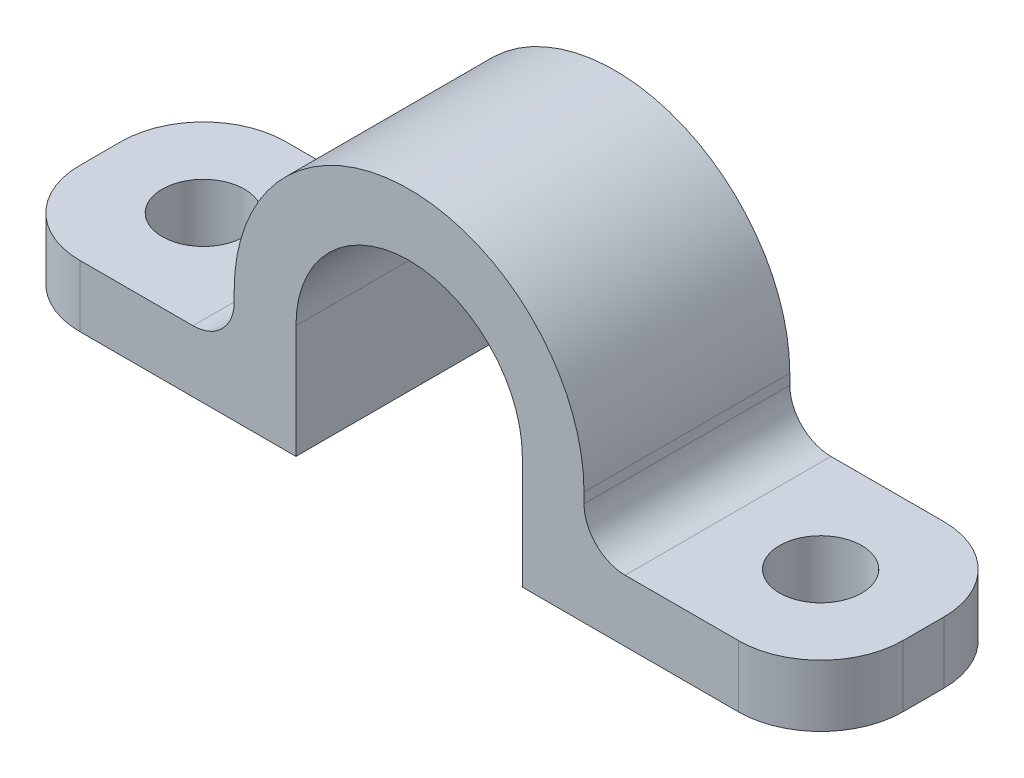
ISO-10303-21;
HEADER;
FILE_DESCRIPTION(('STEP AP214'),'2;1');
FILE_NAME('part.step','',(''),(''),'','','');
FILE_SCHEMA(('AUTOMOTIVE_DESIGN { 1 0 10303 214 1 1 1 1 }'));
ENDSEC;
DATA;
#1=APPLICATION_CONTEXT('core data for automotive mechanical design processes');
#2=APPLICATION_PROTOCOL_DEFINITION('international standard','automotive_design',2000,#1);
#3=PRODUCT_CONTEXT('',#1,'mechanical');
#4=PRODUCT('Part','Part','',(#3));
#5=PRODUCT_RELATED_PRODUCT_CATEGORY('part','',(#4));
#6=PRODUCT_DEFINITION_FORMATION('','',#4);
#7=PRODUCT_DEFINITION_CONTEXT('part definition',#1,'design');
#8=PRODUCT_DEFINITION('design','',#6,#7);
#9=PRODUCT_DEFINITION_SHAPE('','',#8);
#10=(LENGTH_UNIT() NAMED_UNIT(*) SI_UNIT(.MILLI.,.METRE.));
#11=(NAMED_UNIT(*) PLANE_ANGLE_UNIT() SI_UNIT($,.RADIAN.));
#12=(NAMED_UNIT(*) SI_UNIT($,.STERADIAN.) SOLID_ANGLE_UNIT());
#13=UNCERTAINTY_MEASURE_WITH_UNIT(LENGTH_MEASURE(1.E-05),#10,'distance_accuracy_value','');
#14=(GEOMETRIC_REPRESENTATION_CONTEXT(3) GLOBAL_UNCERTAINTY_ASSIGNED_CONTEXT((#13)) GLOBAL_UNIT_ASSIGNED_CONTEXT((#10,
#11,#12)) REPRESENTATION_CONTEXT('',''));
#15=CARTESIAN_POINT('',(0.,0.,0.));
#16=DIRECTION('',(0.,0.,1.));
#17=DIRECTION('',(1.,0.,0.));
#18=AXIS2_PLACEMENT_3D('',#15,#16,#17);
#19=CARTESIAN_POINT('',(0.,-2.5,5.));
#20=DIRECTION('',(0.,1.,0.));
#21=DIRECTION('',(0.,0.,1.));
#22=AXIS2_PLACEMENT_3D('',#19,#20,#21);
#23=PLANE('',#22);
#24=CARTESIAN_POINT('',(15.,-2.5,0.));
#25=DIRECTION('',(0.,1.,0.));
#26=DIRECTION('',(1.,0.,0.));
#27=AXIS2_PLACEMENT_3D('',#24,#25,#26);
#28=CIRCLE('',#27,2.);
#29=CARTESIAN_POINT('',(17.,-2.5,0.));
#30=VERTEX_POINT('',#29);
#31=EDGE_CURVE('E606',#30,#30,#28,.T.);
#32=ORIENTED_EDGE('',*,*,#31,.F.);
#33=EDGE_LOOP('',(#32));
#34=FACE_BOUND('',#33,.T.);
#35=DIRECTION('',(1.,0.,0.));
#36=VECTOR('',#35,1.);
#37=CARTESIAN_POINT('',(0.,-2.5,-5.));
#38=LINE('',#37,#36);
#39=CARTESIAN_POINT('',(10.5,-2.5,-5.));
#40=VERTEX_POINT('',#39);
#41=CARTESIAN_POINT('',(16.,-2.5,-5.));
#42=VERTEX_POINT('',#41);
#43=EDGE_CURVE('E210',#40,#42,#38,.T.);
#44=ORIENTED_EDGE('',*,*,#43,.F.);
#45=DIRECTION('',(0.,0.,-1.));
#46=VECTOR('',#45,1.);
#47=CARTESIAN_POINT('',(10.5,-2.5,5.));
#48=LINE('',#47,#46);
#49=CARTESIAN_POINT('',(10.5,-2.5,5.));
#50=VERTEX_POINT('',#49);
#51=EDGE_CURVE('E293',#40,#50,#48,.F.);
#52=ORIENTED_EDGE('',*,*,#51,.T.);
#53=DIRECTION('',(1.,0.,0.));
#54=VECTOR('',#53,1.);
#55=CARTESIAN_POINT('',(0.,-2.5,5.));
#56=LINE('',#55,#54);
#57=CARTESIAN_POINT('',(16.,-2.5,5.));
#58=VERTEX_POINT('',#57);
#59=EDGE_CURVE('E187',#50,#58,#56,.T.);
#60=ORIENTED_EDGE('',*,*,#59,.T.);
#61=CARTESIAN_POINT('',(16.,-2.5,1.));
#62=DIRECTION('',(0.,1.,0.));
#63=DIRECTION('',(0.,0.,1.));
#64=AXIS2_PLACEMENT_3D('',#61,#62,#63);
#65=CIRCLE('',#64,4.);
#66=CARTESIAN_POINT('',(20.,-2.5,1.));
#67=VERTEX_POINT('',#66);
#68=EDGE_CURVE('E267',#58,#67,#65,.T.);
#69=ORIENTED_EDGE('',*,*,#68,.T.);
#70=DIRECTION('',(0.,0.,-1.));
#71=VECTOR('',#70,1.);
#72=CARTESIAN_POINT('',(20.,-2.5,5.));
#73=LINE('',#72,#71);
#74=CARTESIAN_POINT('',(20.,-2.5,-1.));
#75=VERTEX_POINT('',#74);
#76=EDGE_CURVE('E209',#67,#75,#73,.T.);
#77=ORIENTED_EDGE('',*,*,#76,.T.);
#78=CARTESIAN_POINT('',(16.,-2.5,-1.));
#79=DIRECTION('',(0.,1.,0.));
#80=DIRECTION('',(0.,0.,1.));
#81=AXIS2_PLACEMENT_3D('',#78,#79,#80);
#82=CIRCLE('',#81,4.);
#83=EDGE_CURVE('E269',#75,#42,#82,.T.);
#84=ORIENTED_EDGE('',*,*,#83,.T.);
#85=EDGE_LOOP('',(#44,#52,#60,#69,#77,#84));
#86=FACE_BOUND('',#85,.T.);
#87=ADVANCED_FACE('F36',(#34,#86),#23,.T.);
#88=CARTESIAN_POINT('',(8.5,0.,5.));
#89=DIRECTION('',(1.,0.,0.));
#90=DIRECTION('',(0.,0.,-1.));
#91=AXIS2_PLACEMENT_3D('',#88,#89,#90);
#92=PLANE('',#91);
#93=DIRECTION('',(0.,-1.,0.));
#94=VECTOR('',#93,1.);
#95=CARTESIAN_POINT('',(8.5,0.,5.));
#96=LINE('',#95,#94);
#97=CARTESIAN_POINT('',(8.5,0.,5.));
#98=VERTEX_POINT('',#97);
#99=CARTESIAN_POINT('',(8.5,-0.5,5.));
#100=VERTEX_POINT('',#99);
#101=EDGE_CURVE('E166',#98,#100,#96,.T.);
#102=ORIENTED_EDGE('',*,*,#101,.T.);
#103=DIRECTION('',(0.,0.,-1.));
#104=VECTOR('',#103,1.);
#105=CARTESIAN_POINT('',(8.5,-0.5,-5.));
#106=LINE('',#105,#104);
#107=CARTESIAN_POINT('',(8.5,-0.5,-5.));
#108=VERTEX_POINT('',#107);
#109=EDGE_CURVE('E291',#100,#108,#106,.T.);
#110=ORIENTED_EDGE('',*,*,#109,.T.);
#111=DIRECTION('',(0.,-1.,0.));
#112=VECTOR('',#111,1.);
#113=CARTESIAN_POINT('',(8.5,0.,-5.));
#114=LINE('',#113,#112);
#115=CARTESIAN_POINT('',(8.5,0.,-5.));
#116=VERTEX_POINT('',#115);
#117=EDGE_CURVE('E169',#116,#108,#114,.T.);
#118=ORIENTED_EDGE('',*,*,#117,.F.);
#119=DIRECTION('',(0.,0.,-1.));
#120=VECTOR('',#119,1.);
#121=CARTESIAN_POINT('',(8.5,0.,5.));
#122=LINE('',#121,#120);
#123=EDGE_CURVE('E161',#98,#116,#122,.T.);
#124=ORIENTED_EDGE('',*,*,#123,.F.);
#125=EDGE_LOOP('',(#102,#110,#118,#124));
#126=FACE_BOUND('',#125,.T.);
#127=ADVANCED_FACE('F163',(#126),#92,.T.);
#128=CARTESIAN_POINT('',(0.,0.,5.));
#129=DIRECTION('',(0.,0.,-1.));
#130=DIRECTION('',(-1.,0.,0.));
#131=AXIS2_PLACEMENT_3D('',#128,#129,#130);
#132=CYLINDRICAL_SURFACE('',#131,8.5);
#133=CARTESIAN_POINT('',(0.,0.,-5.));
#134=DIRECTION('',(0.,0.,1.));
#135=DIRECTION('',(1.,0.,0.));
#136=AXIS2_PLACEMENT_3D('',#133,#134,#135);
#137=CIRCLE('',#136,8.5);
#138=CARTESIAN_POINT('',(-8.5,0.,-5.));
#139=VERTEX_POINT('',#138);
#140=EDGE_CURVE('E214',#116,#139,#137,.T.);
#141=ORIENTED_EDGE('',*,*,#140,.T.);
#142=DIRECTION('',(0.,0.,-1.));
#143=VECTOR('',#142,1.);
#144=CARTESIAN_POINT('',(-8.5,0.,5.));
#145=LINE('',#144,#143);
#146=CARTESIAN_POINT('',(-8.5,0.,5.));
#147=VERTEX_POINT('',#146);
#148=EDGE_CURVE('E173',#147,#139,#145,.T.);
#149=ORIENTED_EDGE('',*,*,#148,.F.);
#150=CARTESIAN_POINT('',(0.,0.,5.));
#151=DIRECTION('',(0.,0.,1.));
#152=DIRECTION('',(1.,0.,0.));
#153=AXIS2_PLACEMENT_3D('',#150,#151,#152);
#154=CIRCLE('',#153,8.5);
#155=EDGE_CURVE('E176',#98,#147,#154,.T.);
#156=ORIENTED_EDGE('',*,*,#155,.F.);
#157=ORIENTED_EDGE('',*,*,#123,.T.);
#158=EDGE_LOOP('',(#141,#149,#156,#157));
#159=FACE_BOUND('',#158,.T.);
#160=ADVANCED_FACE('F177',(#159),#132,.T.);
#161=CARTESIAN_POINT('',(-8.5,0.,5.));
#162=DIRECTION('',(1.,0.,0.));
#163=DIRECTION('',(0.,0.,-1.));
#164=AXIS2_PLACEMENT_3D('',#161,#162,#163);
#165=PLANE('',#164);
#166=DIRECTION('',(0.,-1.,0.));
#167=VECTOR('',#166,1.);
#168=CARTESIAN_POINT('',(-8.5,0.,-5.));
#169=LINE('',#168,#167);
#170=CARTESIAN_POINT('',(-8.5,-0.5,-5.));
#171=VERTEX_POINT('',#170);
#172=EDGE_CURVE('E216',#139,#171,#169,.T.);
#173=ORIENTED_EDGE('',*,*,#172,.T.);
#174=DIRECTION('',(0.,0.,-1.));
#175=VECTOR('',#174,1.);
#176=CARTESIAN_POINT('',(-8.5,-0.5,5.));
#177=LINE('',#176,#175);
#178=CARTESIAN_POINT('',(-8.5,-0.5,5.));
#179=VERTEX_POINT('',#178);
#180=EDGE_CURVE('E51',#171,#179,#177,.F.);
#181=ORIENTED_EDGE('',*,*,#180,.T.);
#182=DIRECTION('',(0.,-1.,0.));
#183=VECTOR('',#182,1.);
#184=CARTESIAN_POINT('',(-8.5,0.,5.));
#185=LINE('',#184,#183);
#186=EDGE_CURVE('E180',#147,#179,#185,.T.);
#187=ORIENTED_EDGE('',*,*,#186,.F.);
#188=ORIENTED_EDGE('',*,*,#148,.T.);
#189=EDGE_LOOP('',(#173,#181,#187,#188));
#190=FACE_BOUND('',#189,.T.);
#191=ADVANCED_FACE('F411',(#190),#165,.F.);
#192=CARTESIAN_POINT('',(0.,-2.5,5.));
#193=DIRECTION('',(0.,1.,0.));
#194=DIRECTION('',(0.,0.,1.));
#195=AXIS2_PLACEMENT_3D('',#192,#193,#194);
#196=PLANE('',#195);
#197=CARTESIAN_POINT('',(-15.,-2.5,0.));
#198=DIRECTION('',(0.,1.,0.));
#199=DIRECTION('',(-1.,0.,0.));
#200=AXIS2_PLACEMENT_3D('',#197,#198,#199);
#201=CIRCLE('',#200,2.);
#202=CARTESIAN_POINT('',(-17.,-2.5,0.));
#203=VERTEX_POINT('',#202);
#204=EDGE_CURVE('E602',#203,#203,#201,.T.);
#205=ORIENTED_EDGE('',*,*,#204,.F.);
#206=EDGE_LOOP('',(#205));
#207=FACE_BOUND('',#206,.T.);
#208=DIRECTION('',(1.,0.,0.));
#209=VECTOR('',#208,1.);
#210=CARTESIAN_POINT('',(0.,-2.5,5.));
#211=LINE('',#210,#209);
#212=CARTESIAN_POINT('',(-16.,-2.5,5.));
#213=VERTEX_POINT('',#212);
#214=CARTESIAN_POINT('',(-10.5,-2.5,5.));
#215=VERTEX_POINT('',#214);
#216=EDGE_CURVE('E194',#213,#215,#211,.T.);
#217=ORIENTED_EDGE('',*,*,#216,.T.);
#218=DIRECTION('',(0.,0.,-1.));
#219=VECTOR('',#218,1.);
#220=CARTESIAN_POINT('',(-10.5,-2.5,5.));
#221=LINE('',#220,#219);
#222=CARTESIAN_POINT('',(-10.5,-2.5,-5.));
#223=VERTEX_POINT('',#222);
#224=EDGE_CURVE('E295',#215,#223,#221,.T.);
#225=ORIENTED_EDGE('',*,*,#224,.T.);
#226=DIRECTION('',(1.,0.,0.));
#227=VECTOR('',#226,1.);
#228=CARTESIAN_POINT('',(0.,-2.5,-5.));
#229=LINE('',#228,#227);
#230=CARTESIAN_POINT('',(-16.,-2.5,-5.));
#231=VERTEX_POINT('',#230);
#232=EDGE_CURVE('E218',#231,#223,#229,.T.);
#233=ORIENTED_EDGE('',*,*,#232,.F.);
#234=CARTESIAN_POINT('',(-16.,-2.5,-1.));
#235=DIRECTION('',(0.,1.,0.));
#236=DIRECTION('',(0.,0.,1.));
#237=AXIS2_PLACEMENT_3D('',#234,#235,#236);
#238=CIRCLE('',#237,4.);
#239=CARTESIAN_POINT('',(-20.,-2.5,-1.));
#240=VERTEX_POINT('',#239);
#241=EDGE_CURVE('E289',#231,#240,#238,.T.);
#242=ORIENTED_EDGE('',*,*,#241,.T.);
#243=DIRECTION('',(0.,0.,-1.));
#244=VECTOR('',#243,1.);
#245=CARTESIAN_POINT('',(-20.,-2.5,5.));
#246=LINE('',#245,#244);
#247=CARTESIAN_POINT('',(-20.,-2.5,1.));
#248=VERTEX_POINT('',#247);
#249=EDGE_CURVE('E250',#248,#240,#246,.T.);
#250=ORIENTED_EDGE('',*,*,#249,.F.);
#251=CARTESIAN_POINT('',(-16.,-2.5,1.));
#252=DIRECTION('',(0.,1.,0.));
#253=DIRECTION('',(0.,0.,1.));
#254=AXIS2_PLACEMENT_3D('',#251,#252,#253);
#255=CIRCLE('',#254,4.);
#256=EDGE_CURVE('E287',#248,#213,#255,.T.);
#257=ORIENTED_EDGE('',*,*,#256,.T.);
#258=EDGE_LOOP('',(#217,#225,#233,#242,#250,#257));
#259=FACE_BOUND('',#258,.T.);
#260=ADVANCED_FACE('F348',(#207,#259),#196,.T.);
#261=CARTESIAN_POINT('',(-20.,0.,5.));
#262=DIRECTION('',(1.,0.,0.));
#263=DIRECTION('',(0.,0.,-1.));
#264=AXIS2_PLACEMENT_3D('',#261,#262,#263);
#265=PLANE('',#264);
#266=ORIENTED_EDGE('',*,*,#249,.T.);
#267=DIRECTION('',(0.,-1.,0.));
#268=VECTOR('',#267,1.);
#269=CARTESIAN_POINT('',(-20.,0.,-1.));
#270=LINE('',#269,#268);
#271=CARTESIAN_POINT('',(-20.,-5.5,-1.));
#272=VERTEX_POINT('',#271);
#273=EDGE_CURVE('E280',#240,#272,#270,.T.);
#274=ORIENTED_EDGE('',*,*,#273,.T.);
#275=DIRECTION('',(0.,0.,-1.));
#276=VECTOR('',#275,1.);
#277=CARTESIAN_POINT('',(-20.,-5.5,5.));
#278=LINE('',#277,#276);
#279=CARTESIAN_POINT('',(-20.,-5.5,1.));
#280=VERTEX_POINT('',#279);
#281=EDGE_CURVE('E247',#280,#272,#278,.T.);
#282=ORIENTED_EDGE('',*,*,#281,.F.);
#283=DIRECTION('',(0.,-1.,0.));
#284=VECTOR('',#283,1.);
#285=CARTESIAN_POINT('',(-20.,-2.5,1.));
#286=LINE('',#285,#284);
#287=EDGE_CURVE('E278',#280,#248,#286,.F.);
#288=ORIENTED_EDGE('',*,*,#287,.T.);
#289=EDGE_LOOP('',(#266,#274,#282,#288));
#290=FACE_BOUND('',#289,.T.);
#291=ADVANCED_FACE('F351',(#290),#265,.F.);
#292=CARTESIAN_POINT('',(0.,-5.5,5.));
#293=DIRECTION('',(0.,1.,0.));
#294=DIRECTION('',(0.,0.,1.));
#295=AXIS2_PLACEMENT_3D('',#292,#293,#294);
#296=PLANE('',#295);
#297=CARTESIAN_POINT('',(-15.,-5.50000000000001,0.));
#298=DIRECTION('',(0.,1.,0.));
#299=DIRECTION('',(-1.,0.,0.));
#300=AXIS2_PLACEMENT_3D('',#297,#298,#299);
#301=CIRCLE('',#300,2.);
#302=CARTESIAN_POINT('',(-17.,-5.50000000000001,0.));
#303=VERTEX_POINT('',#302);
#304=EDGE_CURVE('E212',#303,#303,#301,.T.);
#305=ORIENTED_EDGE('',*,*,#304,.T.);
#306=EDGE_LOOP('',(#305));
#307=FACE_BOUND('',#306,.T.);
#308=ORIENTED_EDGE('',*,*,#281,.T.);
#309=CARTESIAN_POINT('',(-16.,-5.5,-1.));
#310=DIRECTION('',(0.,1.,0.));
#311=DIRECTION('',(0.,0.,1.));
#312=AXIS2_PLACEMENT_3D('',#309,#310,#311);
#313=CIRCLE('',#312,4.);
#314=CARTESIAN_POINT('',(-16.,-5.5,-5.));
#315=VERTEX_POINT('',#314);
#316=EDGE_CURVE('E285',#272,#315,#313,.F.);
#317=ORIENTED_EDGE('',*,*,#316,.T.);
#318=DIRECTION('',(1.,0.,0.));
#319=VECTOR('',#318,1.);
#320=CARTESIAN_POINT('',(0.,-5.5,-5.));
#321=LINE('',#320,#319);
#322=CARTESIAN_POINT('',(-5.5,-5.5,-5.));
#323=VERTEX_POINT('',#322);
#324=EDGE_CURVE('E220',#315,#323,#321,.T.);
#325=ORIENTED_EDGE('',*,*,#324,.T.);
#326=DIRECTION('',(0.,0.,-1.));
#327=VECTOR('',#326,1.);
#328=CARTESIAN_POINT('',(-5.5,-5.5,5.));
#329=LINE('',#328,#327);
#330=CARTESIAN_POINT('',(-5.5,-5.5,5.));
#331=VERTEX_POINT('',#330);
#332=EDGE_CURVE('E244',#331,#323,#329,.T.);
#333=ORIENTED_EDGE('',*,*,#332,.F.);
#334=DIRECTION('',(1.,0.,0.));
#335=VECTOR('',#334,1.);
#336=CARTESIAN_POINT('',(0.,-5.5,5.));
#337=LINE('',#336,#335);
#338=CARTESIAN_POINT('',(-16.,-5.5,5.));
#339=VERTEX_POINT('',#338);
#340=EDGE_CURVE('E197',#339,#331,#337,.T.);
#341=ORIENTED_EDGE('',*,*,#340,.F.);
#342=CARTESIAN_POINT('',(-16.,-5.5,1.));
#343=DIRECTION('',(0.,1.,0.));
#344=DIRECTION('',(0.,0.,1.));
#345=AXIS2_PLACEMENT_3D('',#342,#343,#344);
#346=CIRCLE('',#345,4.);
#347=EDGE_CURVE('E283',#339,#280,#346,.F.);
#348=ORIENTED_EDGE('',*,*,#347,.T.);
#349=EDGE_LOOP('',(#308,#317,#325,#333,#341,#348));
#350=FACE_BOUND('',#349,.T.);
#351=ADVANCED_FACE('F363',(#307,#350),#296,.F.);
#352=CARTESIAN_POINT('',(-5.5,0.,5.));
#353=DIRECTION('',(1.,0.,0.));
#354=DIRECTION('',(0.,1.,0.));
#355=AXIS2_PLACEMENT_3D('',#352,#353,#354);
#356=PLANE('',#355);
#357=DIRECTION('',(0.,-1.,0.));
#358=VECTOR('',#357,1.);
#359=CARTESIAN_POINT('',(-5.5,0.,-5.));
#360=LINE('',#359,#358);
#361=CARTESIAN_POINT('',(-5.5,0.,-5.));
#362=VERTEX_POINT('',#361);
#363=EDGE_CURVE('E222',#362,#323,#360,.T.);
#364=ORIENTED_EDGE('',*,*,#363,.F.);
#365=DIRECTION('',(0.,0.,-1.));
#366=VECTOR('',#365,1.);
#367=CARTESIAN_POINT('',(-5.5,0.,5.));
#368=LINE('',#367,#366);
#369=CARTESIAN_POINT('',(-5.5,0.,5.));
#370=VERTEX_POINT('',#369);
#371=EDGE_CURVE('E242',#370,#362,#368,.T.);
#372=ORIENTED_EDGE('',*,*,#371,.F.);
#373=DIRECTION('',(0.,-1.,0.));
#374=VECTOR('',#373,1.);
#375=CARTESIAN_POINT('',(-5.5,0.,5.));
#376=LINE('',#375,#374);
#377=EDGE_CURVE('E199',#370,#331,#376,.T.);
#378=ORIENTED_EDGE('',*,*,#377,.T.);
#379=ORIENTED_EDGE('',*,*,#332,.T.);
#380=EDGE_LOOP('',(#364,#372,#378,#379));
#381=FACE_BOUND('',#380,.T.);
#382=ADVANCED_FACE('F365',(#381),#356,.T.);
#383=CARTESIAN_POINT('',(0.,0.,5.));
#384=DIRECTION('',(0.,0.,-1.));
#385=DIRECTION('',(-1.,0.,0.));
#386=AXIS2_PLACEMENT_3D('',#383,#384,#385);
#387=CYLINDRICAL_SURFACE('',#386,5.5);
#388=CARTESIAN_POINT('',(0.,0.,-5.));
#389=DIRECTION('',(0.,0.,1.));
#390=DIRECTION('',(1.,0.,0.));
#391=AXIS2_PLACEMENT_3D('',#388,#389,#390);
#392=CIRCLE('',#391,5.5);
#393=CARTESIAN_POINT('',(5.5,0.,-5.));
#394=VERTEX_POINT('',#393);
#395=EDGE_CURVE('E225',#394,#362,#392,.T.);
#396=ORIENTED_EDGE('',*,*,#395,.F.);
#397=DIRECTION('',(0.,0.,-1.));
#398=VECTOR('',#397,1.);
#399=CARTESIAN_POINT('',(5.5,0.,5.));
#400=LINE('',#399,#398);
#401=CARTESIAN_POINT('',(5.5,0.,5.));
#402=VERTEX_POINT('',#401);
#403=EDGE_CURVE('E240',#402,#394,#400,.T.);
#404=ORIENTED_EDGE('',*,*,#403,.F.);
#405=CARTESIAN_POINT('',(0.,0.,5.));
#406=DIRECTION('',(0.,0.,1.));
#407=DIRECTION('',(1.,0.,0.));
#408=AXIS2_PLACEMENT_3D('',#405,#406,#407);
#409=CIRCLE('',#408,5.5);
#410=EDGE_CURVE('E202',#402,#370,#409,.T.);
#411=ORIENTED_EDGE('',*,*,#410,.T.);
#412=ORIENTED_EDGE('',*,*,#371,.T.);
#413=EDGE_LOOP('',(#396,#404,#411,#412));
#414=FACE_BOUND('',#413,.T.);
#415=ADVANCED_FACE('F370',(#414),#387,.F.);
#416=CARTESIAN_POINT('',(5.5,0.,5.));
#417=DIRECTION('',(1.,0.,0.));
#418=DIRECTION('',(0.,1.,0.));
#419=AXIS2_PLACEMENT_3D('',#416,#417,#418);
#420=PLANE('',#419);
#421=DIRECTION('',(0.,-1.,0.));
#422=VECTOR('',#421,1.);
#423=CARTESIAN_POINT('',(5.5,0.,-5.));
#424=LINE('',#423,#422);
#425=CARTESIAN_POINT('',(5.5,-5.5,-5.));
#426=VERTEX_POINT('',#425);
#427=EDGE_CURVE('E228',#394,#426,#424,.T.);
#428=ORIENTED_EDGE('',*,*,#427,.T.);
#429=DIRECTION('',(0.,0.,-1.));
#430=VECTOR('',#429,1.);
#431=CARTESIAN_POINT('',(5.5,-5.5,5.));
#432=LINE('',#431,#430);
#433=CARTESIAN_POINT('',(5.5,-5.5,5.));
#434=VERTEX_POINT('',#433);
#435=EDGE_CURVE('E237',#434,#426,#432,.T.);
#436=ORIENTED_EDGE('',*,*,#435,.F.);
#437=DIRECTION('',(0.,-1.,0.));
#438=VECTOR('',#437,1.);
#439=CARTESIAN_POINT('',(5.5,0.,5.));
#440=LINE('',#439,#438);
#441=EDGE_CURVE('E205',#402,#434,#440,.T.);
#442=ORIENTED_EDGE('',*,*,#441,.F.);
#443=ORIENTED_EDGE('',*,*,#403,.T.);
#444=EDGE_LOOP('',(#428,#436,#442,#443));
#445=FACE_BOUND('',#444,.T.);
#446=ADVANCED_FACE('F375',(#445),#420,.F.);
#447=CARTESIAN_POINT('',(0.,-5.5,5.));
#448=DIRECTION('',(0.,1.,0.));
#449=DIRECTION('',(0.,0.,1.));
#450=AXIS2_PLACEMENT_3D('',#447,#448,#449);
#451=PLANE('',#450);
#452=CARTESIAN_POINT('',(15.,-5.5,0.));
#453=DIRECTION('',(0.,1.,0.));
#454=DIRECTION('',(1.,0.,0.));
#455=AXIS2_PLACEMENT_3D('',#452,#453,#454);
#456=CIRCLE('',#455,2.);
#457=CARTESIAN_POINT('',(17.,-5.5,0.));
#458=VERTEX_POINT('',#457);
#459=EDGE_CURVE('E603',#458,#458,#456,.T.);
#460=ORIENTED_EDGE('',*,*,#459,.T.);
#461=EDGE_LOOP('',(#460));
#462=FACE_BOUND('',#461,.T.);
#463=DIRECTION('',(1.,0.,0.));
#464=VECTOR('',#463,1.);
#465=CARTESIAN_POINT('',(0.,-5.5,-5.));
#466=LINE('',#465,#464);
#467=CARTESIAN_POINT('',(16.,-5.5,-5.));
#468=VERTEX_POINT('',#467);
#469=EDGE_CURVE('E189',#426,#468,#466,.T.);
#470=ORIENTED_EDGE('',*,*,#469,.T.);
#471=CARTESIAN_POINT('',(16.,-5.5,-1.));
#472=DIRECTION('',(0.,1.,0.));
#473=DIRECTION('',(0.,0.,1.));
#474=AXIS2_PLACEMENT_3D('',#471,#472,#473);
#475=CIRCLE('',#474,4.);
#476=CARTESIAN_POINT('',(20.,-5.5,-1.));
#477=VERTEX_POINT('',#476);
#478=EDGE_CURVE('E260',#468,#477,#475,.F.);
#479=ORIENTED_EDGE('',*,*,#478,.T.);
#480=DIRECTION('',(0.,0.,-1.));
#481=VECTOR('',#480,1.);
#482=CARTESIAN_POINT('',(20.,-5.5,5.));
#483=LINE('',#482,#481);
#484=CARTESIAN_POINT('',(20.,-5.5,1.));
#485=VERTEX_POINT('',#484);
#486=EDGE_CURVE('E234',#485,#477,#483,.T.);
#487=ORIENTED_EDGE('',*,*,#486,.F.);
#488=CARTESIAN_POINT('',(16.,-5.5,1.));
#489=DIRECTION('',(0.,1.,0.));
#490=DIRECTION('',(0.,0.,1.));
#491=AXIS2_PLACEMENT_3D('',#488,#489,#490);
#492=CIRCLE('',#491,4.);
#493=CARTESIAN_POINT('',(16.,-5.5,5.));
#494=VERTEX_POINT('',#493);
#495=EDGE_CURVE('E258',#485,#494,#492,.F.);
#496=ORIENTED_EDGE('',*,*,#495,.T.);
#497=DIRECTION('',(1.,0.,0.));
#498=VECTOR('',#497,1.);
#499=CARTESIAN_POINT('',(0.,-5.5,5.));
#500=LINE('',#499,#498);
#501=EDGE_CURVE('E207',#434,#494,#500,.T.);
#502=ORIENTED_EDGE('',*,*,#501,.F.);
#503=ORIENTED_EDGE('',*,*,#435,.T.);
#504=EDGE_LOOP('',(#470,#479,#487,#496,#502,#503));
#505=FACE_BOUND('',#504,.T.);
#506=ADVANCED_FACE('F387',(#462,#505),#451,.F.);
#507=CARTESIAN_POINT('',(20.,0.,5.));
#508=DIRECTION('',(1.,0.,0.));
#509=DIRECTION('',(0.,0.,-1.));
#510=AXIS2_PLACEMENT_3D('',#507,#508,#509);
#511=PLANE('',#510);
#512=ORIENTED_EDGE('',*,*,#486,.T.);
#513=DIRECTION('',(0.,-1.,0.));
#514=VECTOR('',#513,1.);
#515=CARTESIAN_POINT('',(20.,-2.5,-1.));
#516=LINE('',#515,#514);
#517=EDGE_CURVE('E265',#477,#75,#516,.F.);
#518=ORIENTED_EDGE('',*,*,#517,.T.);
#519=ORIENTED_EDGE('',*,*,#76,.F.);
#520=DIRECTION('',(0.,-1.,0.));
#521=VECTOR('',#520,1.);
#522=CARTESIAN_POINT('',(20.,0.,1.));
#523=LINE('',#522,#521);
#524=EDGE_CURVE('E262',#67,#485,#523,.T.);
#525=ORIENTED_EDGE('',*,*,#524,.T.);
#526=EDGE_LOOP('',(#512,#518,#519,#525));
#527=FACE_BOUND('',#526,.T.);
#528=ADVANCED_FACE('F383',(#527),#511,.T.);
#529=CARTESIAN_POINT('',(0.,0.,5.));
#530=DIRECTION('',(0.,0.,1.));
#531=DIRECTION('',(1.,0.,0.));
#532=AXIS2_PLACEMENT_3D('',#529,#530,#531);
#533=PLANE('',#532);
#534=ORIENTED_EDGE('',*,*,#501,.T.);
#535=DIRECTION('',(0.,-1.,0.));
#536=VECTOR('',#535,1.);
#537=CARTESIAN_POINT('',(16.,0.,5.));
#538=LINE('',#537,#536);
#539=EDGE_CURVE('E275',#494,#58,#538,.F.);
#540=ORIENTED_EDGE('',*,*,#539,.T.);
#541=ORIENTED_EDGE('',*,*,#59,.F.);
#542=CARTESIAN_POINT('',(10.5,-0.5,5.));
#543=DIRECTION('',(0.,0.,1.));
#544=DIRECTION('',(1.,0.,0.));
#545=AXIS2_PLACEMENT_3D('',#542,#543,#544);
#546=CIRCLE('',#545,2.);
#547=EDGE_CURVE('E186',#50,#100,#546,.F.);
#548=ORIENTED_EDGE('',*,*,#547,.T.);
#549=ORIENTED_EDGE('',*,*,#101,.F.);
#550=ORIENTED_EDGE('',*,*,#155,.T.);
#551=ORIENTED_EDGE('',*,*,#186,.T.);
#552=CARTESIAN_POINT('',(-10.5,-0.5,5.));
#553=DIRECTION('',(0.,0.,1.));
#554=DIRECTION('',(1.,0.,0.));
#555=AXIS2_PLACEMENT_3D('',#552,#553,#554);
#556=CIRCLE('',#555,2.);
#557=EDGE_CURVE('E11',#179,#215,#556,.F.);
#558=ORIENTED_EDGE('',*,*,#557,.T.);
#559=ORIENTED_EDGE('',*,*,#216,.F.);
#560=DIRECTION('',(0.,-1.,0.));
#561=VECTOR('',#560,1.);
#562=CARTESIAN_POINT('',(-16.,-5.5,5.));
#563=LINE('',#562,#561);
#564=EDGE_CURVE('E272',#213,#339,#563,.T.);
#565=ORIENTED_EDGE('',*,*,#564,.T.);
#566=ORIENTED_EDGE('',*,*,#340,.T.);
#567=ORIENTED_EDGE('',*,*,#377,.F.);
#568=ORIENTED_EDGE('',*,*,#410,.F.);
#569=ORIENTED_EDGE('',*,*,#441,.T.);
#570=EDGE_LOOP('',(#534,#540,#541,#548,#549,#550,#551,#558,#559,#565,#566,#567,#568,#569));
#571=FACE_BOUND('',#570,.T.);
#572=ADVANCED_FACE('F183',(#571),#533,.T.);
#573=CARTESIAN_POINT('',(0.,0.,-5.));
#574=DIRECTION('',(0.,0.,1.));
#575=DIRECTION('',(1.,0.,0.));
#576=AXIS2_PLACEMENT_3D('',#573,#574,#575);
#577=PLANE('',#576);
#578=ORIENTED_EDGE('',*,*,#117,.T.);
#579=CARTESIAN_POINT('',(10.5,-0.5,-5.));
#580=DIRECTION('',(0.,0.,1.));
#581=DIRECTION('',(1.,0.,0.));
#582=AXIS2_PLACEMENT_3D('',#579,#580,#581);
#583=CIRCLE('',#582,2.);
#584=EDGE_CURVE('E299',#108,#40,#583,.T.);
#585=ORIENTED_EDGE('',*,*,#584,.T.);
#586=ORIENTED_EDGE('',*,*,#43,.T.);
#587=DIRECTION('',(0.,-1.,0.));
#588=VECTOR('',#587,1.);
#589=CARTESIAN_POINT('',(16.,-5.5,-5.));
#590=LINE('',#589,#588);
#591=EDGE_CURVE('E255',#42,#468,#590,.T.);
#592=ORIENTED_EDGE('',*,*,#591,.T.);
#593=ORIENTED_EDGE('',*,*,#469,.F.);
#594=ORIENTED_EDGE('',*,*,#427,.F.);
#595=ORIENTED_EDGE('',*,*,#395,.T.);
#596=ORIENTED_EDGE('',*,*,#363,.T.);
#597=ORIENTED_EDGE('',*,*,#324,.F.);
#598=DIRECTION('',(0.,-1.,0.));
#599=VECTOR('',#598,1.);
#600=CARTESIAN_POINT('',(-16.,0.,-5.));
#601=LINE('',#600,#599);
#602=EDGE_CURVE('E172',#315,#231,#601,.F.);
#603=ORIENTED_EDGE('',*,*,#602,.T.);
#604=ORIENTED_EDGE('',*,*,#232,.T.);
#605=CARTESIAN_POINT('',(-10.5,-0.5,-5.));
#606=DIRECTION('',(0.,0.,1.));
#607=DIRECTION('',(1.,0.,0.));
#608=AXIS2_PLACEMENT_3D('',#605,#606,#607);
#609=CIRCLE('',#608,2.);
#610=EDGE_CURVE('E44',#223,#171,#609,.T.);
#611=ORIENTED_EDGE('',*,*,#610,.T.);
#612=ORIENTED_EDGE('',*,*,#172,.F.);
#613=ORIENTED_EDGE('',*,*,#140,.F.);
#614=EDGE_LOOP('',(#578,#585,#586,#592,#593,#594,#595,#596,#597,#603,#604,#611,#612,#613));
#615=FACE_BOUND('',#614,.T.);
#616=ADVANCED_FACE('F302',(#615),#577,.F.);
#617=CARTESIAN_POINT('',(15.,-5.5,0.));
#618=DIRECTION('',(0.,1.,0.));
#619=DIRECTION('',(-1.,0.,0.));
#620=AXIS2_PLACEMENT_3D('',#617,#618,#619);
#621=CYLINDRICAL_SURFACE('',#620,2.);
#622=ORIENTED_EDGE('',*,*,#459,.F.);
#623=EDGE_LOOP('',(#622));
#624=FACE_BOUND('',#623,.T.);
#625=ORIENTED_EDGE('',*,*,#31,.T.);
#626=EDGE_LOOP('',(#625));
#627=FACE_BOUND('',#626,.T.);
#628=ADVANCED_FACE('F455',(#624,#627),#621,.F.);
#629=CARTESIAN_POINT('',(-15.,-5.50000000000001,0.));
#630=DIRECTION('',(0.,1.,0.));
#631=DIRECTION('',(-1.,0.,0.));
#632=AXIS2_PLACEMENT_3D('',#629,#630,#631);
#633=CYLINDRICAL_SURFACE('',#632,2.);
#634=ORIENTED_EDGE('',*,*,#304,.F.);
#635=EDGE_LOOP('',(#634));
#636=FACE_BOUND('',#635,.T.);
#637=ORIENTED_EDGE('',*,*,#204,.T.);
#638=EDGE_LOOP('',(#637));
#639=FACE_BOUND('',#638,.T.);
#640=ADVANCED_FACE('F333',(#636,#639),#633,.F.);
#641=CARTESIAN_POINT('',(16.,0.,-1.));
#642=DIRECTION('',(0.,1.,0.));
#643=DIRECTION('',(0.,0.,1.));
#644=AXIS2_PLACEMENT_3D('',#641,#642,#643);
#645=CYLINDRICAL_SURFACE('',#644,4.);
#646=ORIENTED_EDGE('',*,*,#83,.F.);
#647=ORIENTED_EDGE('',*,*,#517,.F.);
#648=ORIENTED_EDGE('',*,*,#478,.F.);
#649=ORIENTED_EDGE('',*,*,#591,.F.);
#650=EDGE_LOOP('',(#646,#647,#648,#649));
#651=FACE_BOUND('',#650,.T.);
#652=ADVANCED_FACE('F329',(#651),#645,.T.);
#653=CARTESIAN_POINT('',(16.,0.,1.));
#654=DIRECTION('',(0.,-1.,0.));
#655=DIRECTION('',(0.,0.,-1.));
#656=AXIS2_PLACEMENT_3D('',#653,#654,#655);
#657=CYLINDRICAL_SURFACE('',#656,4.);
#658=ORIENTED_EDGE('',*,*,#68,.F.);
#659=ORIENTED_EDGE('',*,*,#539,.F.);
#660=ORIENTED_EDGE('',*,*,#495,.F.);
#661=ORIENTED_EDGE('',*,*,#524,.F.);
#662=EDGE_LOOP('',(#658,#659,#660,#661));
#663=FACE_BOUND('',#662,.T.);
#664=ADVANCED_FACE('F332',(#663),#657,.T.);
#665=CARTESIAN_POINT('',(-16.,0.,-1.));
#666=DIRECTION('',(0.,-1.,0.));
#667=DIRECTION('',(0.,0.,-1.));
#668=AXIS2_PLACEMENT_3D('',#665,#666,#667);
#669=CYLINDRICAL_SURFACE('',#668,4.);
#670=ORIENTED_EDGE('',*,*,#241,.F.);
#671=ORIENTED_EDGE('',*,*,#602,.F.);
#672=ORIENTED_EDGE('',*,*,#316,.F.);
#673=ORIENTED_EDGE('',*,*,#273,.F.);
#674=EDGE_LOOP('',(#670,#671,#672,#673));
#675=FACE_BOUND('',#674,.T.);
#676=ADVANCED_FACE('F316',(#675),#669,.T.);
#677=CARTESIAN_POINT('',(-16.,0.,1.));
#678=DIRECTION('',(0.,1.,0.));
#679=DIRECTION('',(0.,0.,1.));
#680=AXIS2_PLACEMENT_3D('',#677,#678,#679);
#681=CYLINDRICAL_SURFACE('',#680,4.);
#682=ORIENTED_EDGE('',*,*,#256,.F.);
#683=ORIENTED_EDGE('',*,*,#287,.F.);
#684=ORIENTED_EDGE('',*,*,#347,.F.);
#685=ORIENTED_EDGE('',*,*,#564,.F.);
#686=EDGE_LOOP('',(#682,#683,#684,#685));
#687=FACE_BOUND('',#686,.T.);
#688=ADVANCED_FACE('F310',(#687),#681,.T.);
#689=CARTESIAN_POINT('',(10.5,-0.5,5.));
#690=DIRECTION('',(0.,0.,1.));
#691=DIRECTION('',(1.,0.,0.));
#692=AXIS2_PLACEMENT_3D('',#689,#690,#691);
#693=CYLINDRICAL_SURFACE('',#692,2.);
#694=ORIENTED_EDGE('',*,*,#547,.F.);
#695=ORIENTED_EDGE('',*,*,#51,.F.);
#696=ORIENTED_EDGE('',*,*,#584,.F.);
#697=ORIENTED_EDGE('',*,*,#109,.F.);
#698=EDGE_LOOP('',(#694,#695,#696,#697));
#699=FACE_BOUND('',#698,.T.);
#700=ADVANCED_FACE('F308',(#699),#693,.F.);
#701=CARTESIAN_POINT('',(-10.5,-0.5,5.));
#702=DIRECTION('',(0.,0.,-1.));
#703=DIRECTION('',(-1.,0.,0.));
#704=AXIS2_PLACEMENT_3D('',#701,#702,#703);
#705=CYLINDRICAL_SURFACE('',#704,2.);
#706=ORIENTED_EDGE('',*,*,#557,.F.);
#707=ORIENTED_EDGE('',*,*,#180,.F.);
#708=ORIENTED_EDGE('',*,*,#610,.F.);
#709=ORIENTED_EDGE('',*,*,#224,.F.);
#710=EDGE_LOOP('',(#706,#707,#708,#709));
#711=FACE_BOUND('',#710,.T.);
#712=ADVANCED_FACE('F38',(#711),#705,.F.);
#713=CLOSED_SHELL('',(#87,#127,#160,#191,#260,#291,#351,#382,#415,#446,#506,#528,#572,#616,#628,
#640,#652,#664,#676,#688,#700,#712));
#714=MANIFOLD_SOLID_BREP('B2',#713);
#715=ADVANCED_BREP_SHAPE_REPRESENTATION('',(#18,#714),#14);
#716=SHAPE_DEFINITION_REPRESENTATION(#9,#715);
ENDSEC;
END-ISO-10303-21;
